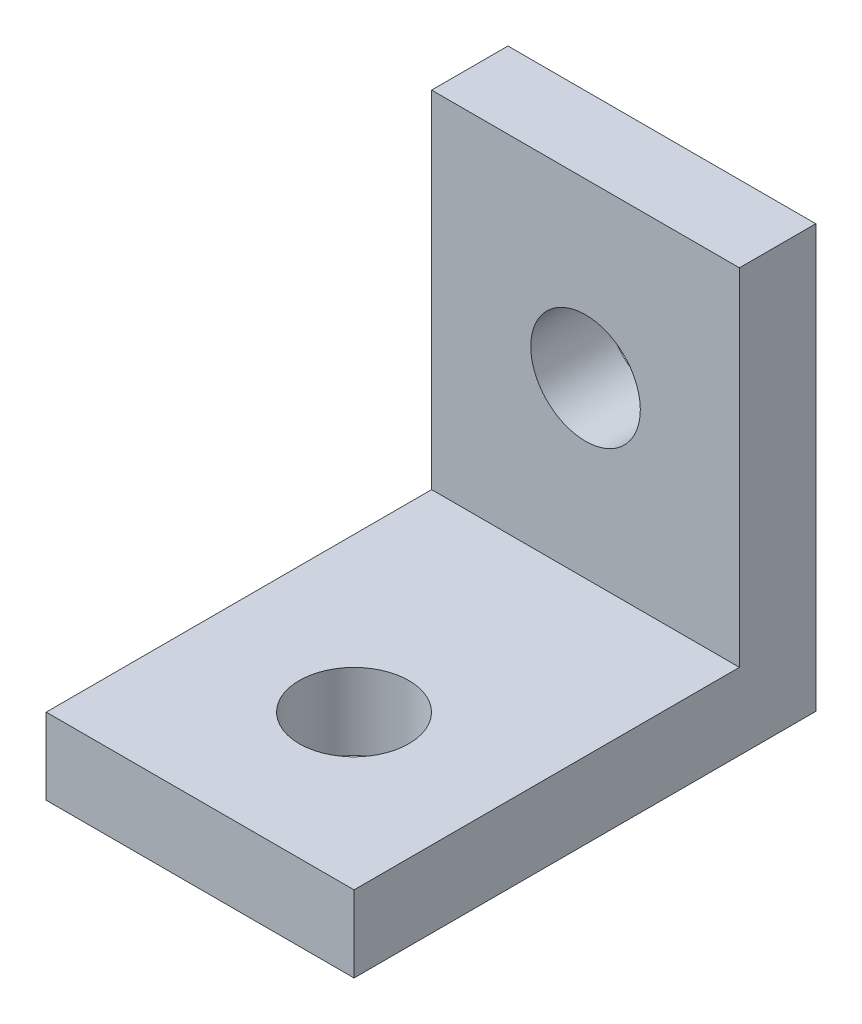
ISO-10303-21;
HEADER;
FILE_DESCRIPTION(('STEP AP214'),'2;1');
FILE_NAME('part.step','',(''),(''),'','','');
FILE_SCHEMA(('AUTOMOTIVE_DESIGN { 1 0 10303 214 1 1 1 1 }'));
ENDSEC;
DATA;
#1=APPLICATION_CONTEXT('core data for automotive mechanical design processes');
#2=APPLICATION_PROTOCOL_DEFINITION('international standard','automotive_design',2000,#1);
#3=PRODUCT_CONTEXT('',#1,'mechanical');
#4=PRODUCT('Part','Part','',(#3));
#5=PRODUCT_RELATED_PRODUCT_CATEGORY('part','',(#4));
#6=PRODUCT_DEFINITION_FORMATION('','',#4);
#7=PRODUCT_DEFINITION_CONTEXT('part definition',#1,'design');
#8=PRODUCT_DEFINITION('design','',#6,#7);
#9=PRODUCT_DEFINITION_SHAPE('','',#8);
#10=(LENGTH_UNIT() NAMED_UNIT(*) SI_UNIT(.MILLI.,.METRE.));
#11=(NAMED_UNIT(*) PLANE_ANGLE_UNIT() SI_UNIT($,.RADIAN.));
#12=(NAMED_UNIT(*) SI_UNIT($,.STERADIAN.) SOLID_ANGLE_UNIT());
#13=UNCERTAINTY_MEASURE_WITH_UNIT(LENGTH_MEASURE(1.E-05),#10,'distance_accuracy_value','');
#14=(GEOMETRIC_REPRESENTATION_CONTEXT(3) GLOBAL_UNCERTAINTY_ASSIGNED_CONTEXT((#13)) GLOBAL_UNIT_ASSIGNED_CONTEXT((#10,
#11,#12)) REPRESENTATION_CONTEXT('',''));
#15=CARTESIAN_POINT('',(0.,0.,0.));
#16=DIRECTION('',(0.,0.,1.));
#17=DIRECTION('',(1.,0.,0.));
#18=AXIS2_PLACEMENT_3D('',#15,#16,#17);
#19=CARTESIAN_POINT('',(-3.175,1.5748,4.7625));
#20=DIRECTION('',(1.,0.,0.));
#21=DIRECTION('',(0.,0.,-1.));
#22=AXIS2_PLACEMENT_3D('',#19,#20,#21);
#23=PLANE('',#22);
#24=DIRECTION('',(0.,0.,1.));
#25=VECTOR('',#24,1.);
#26=CARTESIAN_POINT('',(-3.175,0.,4.7625));
#27=LINE('',#26,#25);
#28=CARTESIAN_POINT('',(-3.175,0.,-4.7625));
#29=VERTEX_POINT('',#28);
#30=CARTESIAN_POINT('',(-3.175,0.,4.7625));
#31=VERTEX_POINT('',#30);
#32=EDGE_CURVE('E93',#29,#31,#27,.T.);
#33=ORIENTED_EDGE('',*,*,#32,.T.);
#34=DIRECTION('',(0.,-1.,0.));
#35=VECTOR('',#34,1.);
#36=CARTESIAN_POINT('',(-3.175,1.5748,4.7625));
#37=LINE('',#36,#35);
#38=CARTESIAN_POINT('',(-3.175,1.5748,4.7625));
#39=VERTEX_POINT('',#38);
#40=EDGE_CURVE('E11',#39,#31,#37,.T.);
#41=ORIENTED_EDGE('',*,*,#40,.F.);
#42=DIRECTION('',(0.,0.,1.));
#43=VECTOR('',#42,1.);
#44=CARTESIAN_POINT('',(-3.175,1.5748,4.7625));
#45=LINE('',#44,#43);
#46=CARTESIAN_POINT('',(-3.175,1.5748,-3.18769999999999));
#47=VERTEX_POINT('',#46);
#48=EDGE_CURVE('E86',#47,#39,#45,.T.);
#49=ORIENTED_EDGE('',*,*,#48,.F.);
#50=DIRECTION('',(0.,-1.,0.));
#51=VECTOR('',#50,1.);
#52=CARTESIAN_POINT('',(-3.175,8.7122,-3.1877));
#53=LINE('',#52,#51);
#54=CARTESIAN_POINT('',(-3.175,8.7122,-3.1877));
#55=VERTEX_POINT('',#54);
#56=EDGE_CURVE('E135',#55,#47,#53,.T.);
#57=ORIENTED_EDGE('',*,*,#56,.F.);
#58=DIRECTION('',(0.,0.,1.));
#59=VECTOR('',#58,1.);
#60=CARTESIAN_POINT('',(-3.175,8.7122,-4.7625));
#61=LINE('',#60,#59);
#62=CARTESIAN_POINT('',(-3.175,8.7122,-4.7625));
#63=VERTEX_POINT('',#62);
#64=EDGE_CURVE('E96',#63,#55,#61,.T.);
#65=ORIENTED_EDGE('',*,*,#64,.F.);
#66=DIRECTION('',(0.,-1.,0.));
#67=VECTOR('',#66,1.);
#68=CARTESIAN_POINT('',(-3.175,1.5748,-4.7625));
#69=LINE('',#68,#67);
#70=EDGE_CURVE('E79',#63,#29,#69,.T.);
#71=ORIENTED_EDGE('',*,*,#70,.T.);
#72=EDGE_LOOP('',(#33,#41,#49,#57,#65,#71));
#73=FACE_BOUND('',#72,.T.);
#74=ADVANCED_FACE('F33',(#73),#23,.F.);
#75=CARTESIAN_POINT('',(3.175,1.5748,4.7625));
#76=DIRECTION('',(0.,0.,-1.));
#77=DIRECTION('',(-1.,0.,0.));
#78=AXIS2_PLACEMENT_3D('',#75,#76,#77);
#79=PLANE('',#78);
#80=DIRECTION('',(1.,0.,0.));
#81=VECTOR('',#80,1.);
#82=CARTESIAN_POINT('',(3.175,0.,4.7625));
#83=LINE('',#82,#81);
#84=CARTESIAN_POINT('',(3.175,0.,4.7625));
#85=VERTEX_POINT('',#84);
#86=EDGE_CURVE('E100',#31,#85,#83,.T.);
#87=ORIENTED_EDGE('',*,*,#86,.T.);
#88=DIRECTION('',(0.,-1.,0.));
#89=VECTOR('',#88,1.);
#90=CARTESIAN_POINT('',(3.175,1.5748,4.7625));
#91=LINE('',#90,#89);
#92=CARTESIAN_POINT('',(3.175,1.5748,4.7625));
#93=VERTEX_POINT('',#92);
#94=EDGE_CURVE('E41',#93,#85,#91,.T.);
#95=ORIENTED_EDGE('',*,*,#94,.F.);
#96=DIRECTION('',(1.,0.,0.));
#97=VECTOR('',#96,1.);
#98=CARTESIAN_POINT('',(3.175,1.5748,4.7625));
#99=LINE('',#98,#97);
#100=EDGE_CURVE('E55',#39,#93,#99,.T.);
#101=ORIENTED_EDGE('',*,*,#100,.F.);
#102=ORIENTED_EDGE('',*,*,#40,.T.);
#103=EDGE_LOOP('',(#87,#95,#101,#102));
#104=FACE_BOUND('',#103,.T.);
#105=ADVANCED_FACE('F179',(#104),#79,.F.);
#106=CARTESIAN_POINT('',(3.175,1.5748,4.7625));
#107=DIRECTION('',(-1.,0.,0.));
#108=DIRECTION('',(0.,0.,1.));
#109=AXIS2_PLACEMENT_3D('',#106,#107,#108);
#110=PLANE('',#109);
#111=DIRECTION('',(0.,0.,-1.));
#112=VECTOR('',#111,1.);
#113=CARTESIAN_POINT('',(3.175,0.,4.7625));
#114=LINE('',#113,#112);
#115=CARTESIAN_POINT('',(3.175,0.,-4.7625));
#116=VERTEX_POINT('',#115);
#117=EDGE_CURVE('E87',#85,#116,#114,.T.);
#118=ORIENTED_EDGE('',*,*,#117,.T.);
#119=DIRECTION('',(0.,-1.,0.));
#120=VECTOR('',#119,1.);
#121=CARTESIAN_POINT('',(3.175,1.5748,-4.7625));
#122=LINE('',#121,#120);
#123=CARTESIAN_POINT('',(3.175,8.7122,-4.7625));
#124=VERTEX_POINT('',#123);
#125=EDGE_CURVE('E82',#124,#116,#122,.T.);
#126=ORIENTED_EDGE('',*,*,#125,.F.);
#127=DIRECTION('',(0.,0.,-1.));
#128=VECTOR('',#127,1.);
#129=CARTESIAN_POINT('',(3.175,8.7122,-4.7625));
#130=LINE('',#129,#128);
#131=CARTESIAN_POINT('',(3.175,8.7122,-3.1877));
#132=VERTEX_POINT('',#131);
#133=EDGE_CURVE('E139',#132,#124,#130,.T.);
#134=ORIENTED_EDGE('',*,*,#133,.F.);
#135=DIRECTION('',(0.,-1.,0.));
#136=VECTOR('',#135,1.);
#137=CARTESIAN_POINT('',(3.175,8.7122,-3.1877));
#138=LINE('',#137,#136);
#139=CARTESIAN_POINT('',(3.175,1.5748,-3.1877));
#140=VERTEX_POINT('',#139);
#141=EDGE_CURVE('E133',#132,#140,#138,.T.);
#142=ORIENTED_EDGE('',*,*,#141,.T.);
#143=DIRECTION('',(0.,0.,-1.));
#144=VECTOR('',#143,1.);
#145=CARTESIAN_POINT('',(3.175,1.5748,4.7625));
#146=LINE('',#145,#144);
#147=EDGE_CURVE('E97',#93,#140,#146,.T.);
#148=ORIENTED_EDGE('',*,*,#147,.F.);
#149=ORIENTED_EDGE('',*,*,#94,.T.);
#150=EDGE_LOOP('',(#118,#126,#134,#142,#148,#149));
#151=FACE_BOUND('',#150,.T.);
#152=ADVANCED_FACE('F137',(#151),#110,.F.);
#153=CARTESIAN_POINT('',(3.175,1.5748,-4.7625));
#154=DIRECTION('',(0.,0.,1.));
#155=DIRECTION('',(1.,0.,0.));
#156=AXIS2_PLACEMENT_3D('',#153,#154,#155);
#157=PLANE('',#156);
#158=CARTESIAN_POINT('',(0.,5.1562,-4.7625));
#159=DIRECTION('',(0.,0.,1.));
#160=DIRECTION('',(1.,0.,0.));
#161=AXIS2_PLACEMENT_3D('',#158,#159,#160);
#162=CIRCLE('',#161,1.1303);
#163=CARTESIAN_POINT('',(1.1303,5.1562,-4.7625));
#164=VERTEX_POINT('',#163);
#165=EDGE_CURVE('E136',#164,#164,#162,.T.);
#166=ORIENTED_EDGE('',*,*,#165,.T.);
#167=EDGE_LOOP('',(#166));
#168=FACE_BOUND('',#167,.T.);
#169=DIRECTION('',(-1.,0.,0.));
#170=VECTOR('',#169,1.);
#171=CARTESIAN_POINT('',(3.175,0.,-4.7625));
#172=LINE('',#171,#170);
#173=EDGE_CURVE('E75',#116,#29,#172,.T.);
#174=ORIENTED_EDGE('',*,*,#173,.T.);
#175=ORIENTED_EDGE('',*,*,#70,.F.);
#176=DIRECTION('',(-1.,0.,0.));
#177=VECTOR('',#176,1.);
#178=CARTESIAN_POINT('',(-3.175,8.7122,-4.7625));
#179=LINE('',#178,#177);
#180=EDGE_CURVE('E140',#124,#63,#179,.T.);
#181=ORIENTED_EDGE('',*,*,#180,.F.);
#182=ORIENTED_EDGE('',*,*,#125,.T.);
#183=EDGE_LOOP('',(#174,#175,#181,#182));
#184=FACE_BOUND('',#183,.T.);
#185=ADVANCED_FACE('F77',(#168,#184),#157,.F.);
#186=CARTESIAN_POINT('',(0.,1.5748,0.));
#187=DIRECTION('',(0.,1.,0.));
#188=DIRECTION('',(0.,0.,1.));
#189=AXIS2_PLACEMENT_3D('',#186,#187,#188);
#190=PLANE('',#189);
#191=DIRECTION('',(1.,0.,0.));
#192=VECTOR('',#191,1.);
#193=CARTESIAN_POINT('',(-3.175,1.5748,-3.1877));
#194=LINE('',#193,#192);
#195=EDGE_CURVE('E49',#47,#140,#194,.T.);
#196=ORIENTED_EDGE('',*,*,#195,.F.);
#197=ORIENTED_EDGE('',*,*,#48,.T.);
#198=ORIENTED_EDGE('',*,*,#100,.T.);
#199=ORIENTED_EDGE('',*,*,#147,.T.);
#200=EDGE_LOOP('',(#196,#197,#198,#199));
#201=FACE_BOUND('',#200,.T.);
#202=CARTESIAN_POINT('',(0.,1.5748,1.5875));
#203=DIRECTION('',(0.,1.,0.));
#204=DIRECTION('',(0.,0.,1.));
#205=AXIS2_PLACEMENT_3D('',#202,#203,#204);
#206=CIRCLE('',#205,1.1303);
#207=CARTESIAN_POINT('',(0.,1.5748,2.7178));
#208=VERTEX_POINT('',#207);
#209=EDGE_CURVE('E105',#208,#208,#206,.T.);
#210=ORIENTED_EDGE('',*,*,#209,.F.);
#211=EDGE_LOOP('',(#210));
#212=FACE_BOUND('',#211,.T.);
#213=ADVANCED_FACE('F122',(#201,#212),#190,.T.);
#214=CARTESIAN_POINT('',(0.,0.,0.));
#215=DIRECTION('',(0.,1.,0.));
#216=DIRECTION('',(0.,0.,1.));
#217=AXIS2_PLACEMENT_3D('',#214,#215,#216);
#218=PLANE('',#217);
#219=CARTESIAN_POINT('',(0.,0.,1.5875));
#220=DIRECTION('',(0.,1.,0.));
#221=DIRECTION('',(0.,0.,1.));
#222=AXIS2_PLACEMENT_3D('',#219,#220,#221);
#223=CIRCLE('',#222,1.1303);
#224=CARTESIAN_POINT('',(0.,0.,2.7178));
#225=VERTEX_POINT('',#224);
#226=EDGE_CURVE('E101',#225,#225,#223,.T.);
#227=ORIENTED_EDGE('',*,*,#226,.T.);
#228=EDGE_LOOP('',(#227));
#229=FACE_BOUND('',#228,.T.);
#230=ORIENTED_EDGE('',*,*,#32,.F.);
#231=ORIENTED_EDGE('',*,*,#173,.F.);
#232=ORIENTED_EDGE('',*,*,#117,.F.);
#233=ORIENTED_EDGE('',*,*,#86,.F.);
#234=EDGE_LOOP('',(#230,#231,#232,#233));
#235=FACE_BOUND('',#234,.T.);
#236=ADVANCED_FACE('F99',(#229,#235),#218,.F.);
#237=CARTESIAN_POINT('',(0.,0.,1.5875));
#238=DIRECTION('',(0.,1.,0.));
#239=DIRECTION('',(0.,0.,1.));
#240=AXIS2_PLACEMENT_3D('',#237,#238,#239);
#241=CYLINDRICAL_SURFACE('',#240,1.1303);
#242=ORIENTED_EDGE('',*,*,#226,.F.);
#243=EDGE_LOOP('',(#242));
#244=FACE_BOUND('',#243,.T.);
#245=ORIENTED_EDGE('',*,*,#209,.T.);
#246=EDGE_LOOP('',(#245));
#247=FACE_BOUND('',#246,.T.);
#248=ADVANCED_FACE('F168',(#244,#247),#241,.F.);
#249=CARTESIAN_POINT('',(-3.175,8.7122,-3.1877));
#250=DIRECTION('',(0.,0.,-1.));
#251=DIRECTION('',(-1.,0.,0.));
#252=AXIS2_PLACEMENT_3D('',#249,#250,#251);
#253=PLANE('',#252);
#254=CARTESIAN_POINT('',(0.,5.1562,-3.1877));
#255=DIRECTION('',(0.,0.,1.));
#256=DIRECTION('',(1.,0.,0.));
#257=AXIS2_PLACEMENT_3D('',#254,#255,#256);
#258=CIRCLE('',#257,1.1303);
#259=CARTESIAN_POINT('',(1.1303,5.1562,-3.1877));
#260=VERTEX_POINT('',#259);
#261=EDGE_CURVE('E153',#260,#260,#258,.T.);
#262=ORIENTED_EDGE('',*,*,#261,.F.);
#263=EDGE_LOOP('',(#262));
#264=FACE_BOUND('',#263,.T.);
#265=ORIENTED_EDGE('',*,*,#195,.T.);
#266=ORIENTED_EDGE('',*,*,#141,.F.);
#267=DIRECTION('',(1.,0.,0.));
#268=VECTOR('',#267,1.);
#269=CARTESIAN_POINT('',(-3.175,8.7122,-3.1877));
#270=LINE('',#269,#268);
#271=EDGE_CURVE('E149',#55,#132,#270,.T.);
#272=ORIENTED_EDGE('',*,*,#271,.F.);
#273=ORIENTED_EDGE('',*,*,#56,.T.);
#274=EDGE_LOOP('',(#265,#266,#272,#273));
#275=FACE_BOUND('',#274,.T.);
#276=ADVANCED_FACE('F130',(#264,#275),#253,.F.);
#277=CARTESIAN_POINT('',(0.,8.7122,0.));
#278=DIRECTION('',(0.,1.,0.));
#279=DIRECTION('',(0.,0.,1.));
#280=AXIS2_PLACEMENT_3D('',#277,#278,#279);
#281=PLANE('',#280);
#282=ORIENTED_EDGE('',*,*,#64,.T.);
#283=ORIENTED_EDGE('',*,*,#271,.T.);
#284=ORIENTED_EDGE('',*,*,#133,.T.);
#285=ORIENTED_EDGE('',*,*,#180,.T.);
#286=EDGE_LOOP('',(#282,#283,#284,#285));
#287=FACE_BOUND('',#286,.T.);
#288=ADVANCED_FACE('F163',(#287),#281,.T.);
#289=CARTESIAN_POINT('',(0.,5.1562,-4.7625));
#290=DIRECTION('',(0.,0.,1.));
#291=DIRECTION('',(1.,0.,0.));
#292=AXIS2_PLACEMENT_3D('',#289,#290,#291);
#293=CYLINDRICAL_SURFACE('',#292,1.1303);
#294=ORIENTED_EDGE('',*,*,#165,.F.);
#295=EDGE_LOOP('',(#294));
#296=FACE_BOUND('',#295,.T.);
#297=ORIENTED_EDGE('',*,*,#261,.T.);
#298=EDGE_LOOP('',(#297));
#299=FACE_BOUND('',#298,.T.);
#300=ADVANCED_FACE('F160',(#296,#299),#293,.F.);
#301=CLOSED_SHELL('',(#74,#105,#152,#185,#213,#236,#248,#276,#288,#300));
#302=MANIFOLD_SOLID_BREP('B2',#301);
#303=ADVANCED_BREP_SHAPE_REPRESENTATION('',(#18,#302),#14);
#304=SHAPE_DEFINITION_REPRESENTATION(#9,#303);
ENDSEC;
END-ISO-10303-21;
